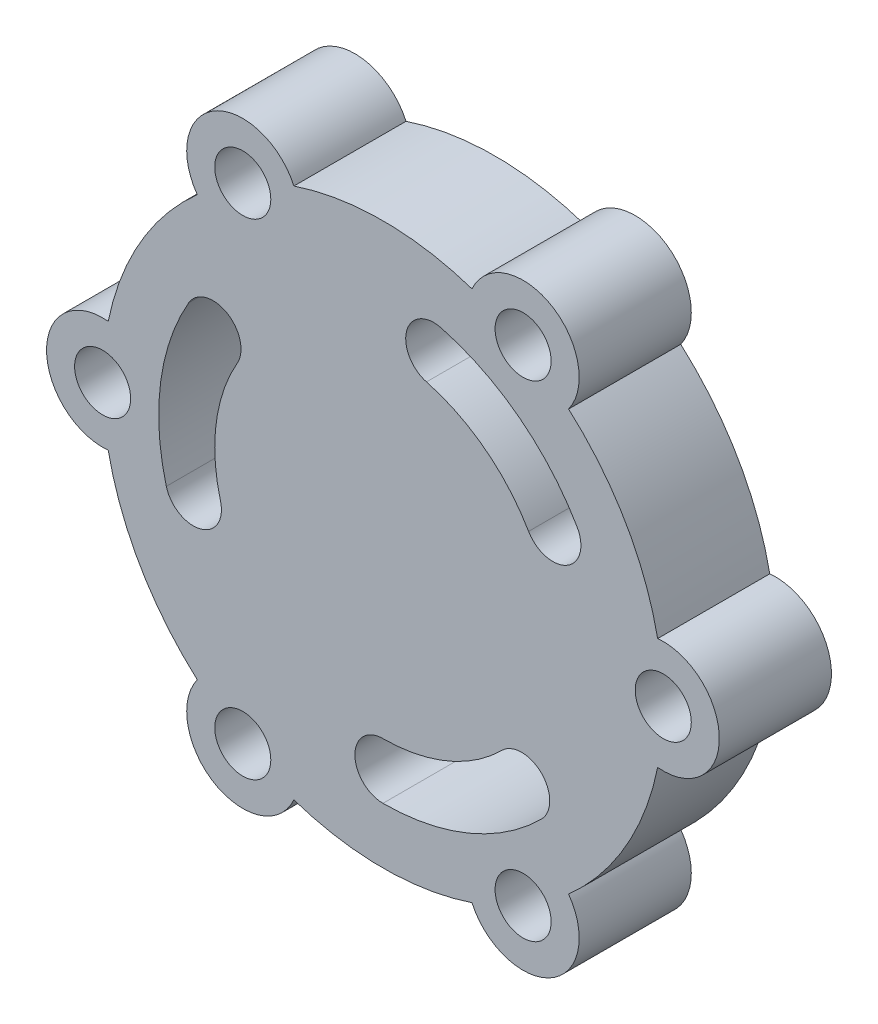
ISO-10303-21;
HEADER;
FILE_DESCRIPTION(('STEP AP214'),'2;1');
FILE_NAME('part.step','',(''),(''),'','','');
FILE_SCHEMA(('AUTOMOTIVE_DESIGN { 1 0 10303 214 1 1 1 1 }'));
ENDSEC;
DATA;
#1=APPLICATION_CONTEXT('core data for automotive mechanical design processes');
#2=APPLICATION_PROTOCOL_DEFINITION('international standard','automotive_design',2000,#1);
#3=PRODUCT_CONTEXT('',#1,'mechanical');
#4=PRODUCT('Part','Part','',(#3));
#5=PRODUCT_RELATED_PRODUCT_CATEGORY('part','',(#4));
#6=PRODUCT_DEFINITION_FORMATION('','',#4);
#7=PRODUCT_DEFINITION_CONTEXT('part definition',#1,'design');
#8=PRODUCT_DEFINITION('design','',#6,#7);
#9=PRODUCT_DEFINITION_SHAPE('','',#8);
#10=(LENGTH_UNIT() NAMED_UNIT(*) SI_UNIT(.MILLI.,.METRE.));
#11=(NAMED_UNIT(*) PLANE_ANGLE_UNIT() SI_UNIT($,.RADIAN.));
#12=(NAMED_UNIT(*) SI_UNIT($,.STERADIAN.) SOLID_ANGLE_UNIT());
#13=UNCERTAINTY_MEASURE_WITH_UNIT(LENGTH_MEASURE(1.E-05),#10,'distance_accuracy_value','');
#14=(GEOMETRIC_REPRESENTATION_CONTEXT(3) GLOBAL_UNCERTAINTY_ASSIGNED_CONTEXT((#13)) GLOBAL_UNIT_ASSIGNED_CONTEXT((#10,
#11,#12)) REPRESENTATION_CONTEXT('',''));
#15=CARTESIAN_POINT('',(0.,0.,0.));
#16=DIRECTION('',(0.,0.,1.));
#17=DIRECTION('',(1.,0.,0.));
#18=AXIS2_PLACEMENT_3D('',#15,#16,#17);
#19=CARTESIAN_POINT('',(-25.,0.,20.));
#20=DIRECTION('',(0.,0.,1.));
#21=DIRECTION('',(1.,0.,0.));
#22=AXIS2_PLACEMENT_3D('',#19,#20,#21);
#23=PLANE('',#22);
#24=CARTESIAN_POINT('',(24.9999999999996,-43.3012701892222,20.));
#25=DIRECTION('',(0.,0.,1.));
#26=DIRECTION('',(1.,0.,0.));
#27=AXIS2_PLACEMENT_3D('',#24,#25,#26);
#28=CIRCLE('',#27,5.);
#29=CARTESIAN_POINT('',(29.9999999999996,-43.3012701892222,20.));
#30=VERTEX_POINT('',#29);
#31=EDGE_CURVE('E236',#30,#30,#28,.T.);
#32=ORIENTED_EDGE('',*,*,#31,.F.);
#33=EDGE_LOOP('',(#32));
#34=FACE_BOUND('',#33,.T.);
#35=CARTESIAN_POINT('',(25.0000000000002,43.3012701892218,20.));
#36=DIRECTION('',(0.,0.,1.));
#37=DIRECTION('',(1.,0.,0.));
#38=AXIS2_PLACEMENT_3D('',#35,#36,#37);
#39=CIRCLE('',#38,5.);
#40=CARTESIAN_POINT('',(30.0000000000002,43.3012701892218,20.));
#41=VERTEX_POINT('',#40);
#42=EDGE_CURVE('E248',#41,#41,#39,.T.);
#43=ORIENTED_EDGE('',*,*,#42,.F.);
#44=EDGE_LOOP('',(#43));
#45=FACE_BOUND('',#44,.T.);
#46=CARTESIAN_POINT('',(0.,0.,20.));
#47=DIRECTION('',(0.,0.,1.));
#48=DIRECTION('',(1.,0.,0.));
#49=AXIS2_PLACEMENT_3D('',#46,#47,#48);
#50=CIRCLE('',#49,40.);
#51=CARTESIAN_POINT('',(-1.13929291158899E-13,-40.,20.));
#52=VERTEX_POINT('',#51);
#53=CARTESIAN_POINT('',(28.2842712474619,-28.2842712474619,20.));
#54=VERTEX_POINT('',#53);
#55=EDGE_CURVE('E262',#52,#54,#50,.T.);
#56=ORIENTED_EDGE('',*,*,#55,.F.);
#57=CARTESIAN_POINT('',(0.,-35.,20.));
#58=DIRECTION('',(0.,0.,1.));
#59=DIRECTION('',(1.,0.,0.));
#60=AXIS2_PLACEMENT_3D('',#57,#58,#59);
#61=CIRCLE('',#60,5.);
#62=CARTESIAN_POINT('',(0.,-30.,20.));
#63=VERTEX_POINT('',#62);
#64=EDGE_CURVE('E260',#63,#52,#61,.T.);
#65=ORIENTED_EDGE('',*,*,#64,.F.);
#66=CARTESIAN_POINT('',(0.,0.,20.));
#67=DIRECTION('',(0.,0.,-1.));
#68=DIRECTION('',(1.,0.,0.));
#69=AXIS2_PLACEMENT_3D('',#66,#67,#68);
#70=CIRCLE('',#69,30.);
#71=CARTESIAN_POINT('',(21.2132034355964,-21.2132034355965,20.));
#72=VERTEX_POINT('',#71);
#73=EDGE_CURVE('E268',#72,#63,#70,.T.);
#74=ORIENTED_EDGE('',*,*,#73,.F.);
#75=CARTESIAN_POINT('',(24.7487373415291,-24.7487373415292,20.));
#76=DIRECTION('',(0.,0.,1.));
#77=DIRECTION('',(1.,0.,0.));
#78=AXIS2_PLACEMENT_3D('',#75,#76,#77);
#79=CIRCLE('',#78,5.);
#80=EDGE_CURVE('E265',#54,#72,#79,.T.);
#81=ORIENTED_EDGE('',*,*,#80,.F.);
#82=EDGE_LOOP('',(#56,#65,#74,#81));
#83=FACE_BOUND('',#82,.T.);
#84=CARTESIAN_POINT('',(0.,0.,20.));
#85=DIRECTION('',(0.,0.,1.));
#86=DIRECTION('',(1.,0.,0.));
#87=AXIS2_PLACEMENT_3D('',#84,#85,#86);
#88=CIRCLE('',#87,40.);
#89=CARTESIAN_POINT('',(34.6410161513775,20.0000000000001,20.));
#90=VERTEX_POINT('',#89);
#91=CARTESIAN_POINT('',(10.3527618041007,38.6370330515628,20.));
#92=VERTEX_POINT('',#91);
#93=EDGE_CURVE('E293',#90,#92,#88,.T.);
#94=ORIENTED_EDGE('',*,*,#93,.F.);
#95=CARTESIAN_POINT('',(30.3108891324553,17.5000000000001,20.));
#96=DIRECTION('',(0.,0.,1.));
#97=DIRECTION('',(1.,0.,0.));
#98=AXIS2_PLACEMENT_3D('',#95,#96,#97);
#99=CIRCLE('',#98,5.);
#100=CARTESIAN_POINT('',(25.9807621135331,15.0000000000001,20.));
#101=VERTEX_POINT('',#100);
#102=EDGE_CURVE('E291',#101,#90,#99,.T.);
#103=ORIENTED_EDGE('',*,*,#102,.F.);
#104=CARTESIAN_POINT('',(0.,0.,20.));
#105=DIRECTION('',(0.,0.,-1.));
#106=DIRECTION('',(1.,0.,0.));
#107=AXIS2_PLACEMENT_3D('',#104,#105,#106);
#108=CIRCLE('',#107,30.);
#109=CARTESIAN_POINT('',(7.76457135307553,28.9777747886721,20.));
#110=VERTEX_POINT('',#109);
#111=EDGE_CURVE('E299',#110,#101,#108,.T.);
#112=ORIENTED_EDGE('',*,*,#111,.F.);
#113=CARTESIAN_POINT('',(9.05866657858811,33.8074039201174,20.));
#114=DIRECTION('',(0.,0.,1.));
#115=DIRECTION('',(1.,0.,0.));
#116=AXIS2_PLACEMENT_3D('',#113,#114,#115);
#117=CIRCLE('',#116,5.);
#118=EDGE_CURVE('E296',#92,#110,#117,.T.);
#119=ORIENTED_EDGE('',*,*,#118,.F.);
#120=EDGE_LOOP('',(#94,#103,#112,#119));
#121=FACE_BOUND('',#120,.T.);
#122=CARTESIAN_POINT('',(-50.,0.,20.));
#123=DIRECTION('',(0.,0.,1.));
#124=DIRECTION('',(1.,0.,0.));
#125=AXIS2_PLACEMENT_3D('',#122,#123,#124);
#126=CIRCLE('',#125,5.);
#127=CARTESIAN_POINT('',(-45.,0.,20.));
#128=VERTEX_POINT('',#127);
#129=EDGE_CURVE('E322',#128,#128,#126,.T.);
#130=ORIENTED_EDGE('',*,*,#129,.F.);
#131=EDGE_LOOP('',(#130));
#132=FACE_BOUND('',#131,.T.);
#133=CARTESIAN_POINT('',(-50.,0.,20.));
#134=DIRECTION('',(0.,0.,1.));
#135=DIRECTION('',(1.,0.,0.));
#136=AXIS2_PLACEMENT_3D('',#133,#134,#135);
#137=CIRCLE('',#136,10.);
#138=CARTESIAN_POINT('',(-49.,9.9498743710662,20.));
#139=VERTEX_POINT('',#138);
#140=CARTESIAN_POINT('',(-49.,-9.94987437106619,20.));
#141=VERTEX_POINT('',#140);
#142=EDGE_CURVE('E328',#139,#141,#137,.T.);
#143=ORIENTED_EDGE('',*,*,#142,.T.);
#144=CARTESIAN_POINT('',(0.,0.,20.));
#145=DIRECTION('',(0.,0.,1.));
#146=DIRECTION('',(1.,0.,0.));
#147=AXIS2_PLACEMENT_3D('',#144,#145,#146);
#148=CIRCLE('',#147,50.);
#149=CARTESIAN_POINT('',(-33.1168439698075,-37.460307599904,20.));
#150=VERTEX_POINT('',#149);
#151=EDGE_CURVE('E331',#141,#150,#148,.T.);
#152=ORIENTED_EDGE('',*,*,#151,.T.);
#153=CARTESIAN_POINT('',(-25.,-43.301270189222,20.));
#154=DIRECTION('',(0.,0.,1.));
#155=DIRECTION('',(1.,0.,0.));
#156=AXIS2_PLACEMENT_3D('',#153,#154,#155);
#157=CIRCLE('',#156,10.);
#158=CARTESIAN_POINT('',(-15.8831560301929,-47.4101819709707,20.));
#159=VERTEX_POINT('',#158);
#160=EDGE_CURVE('E334',#150,#159,#157,.T.);
#161=ORIENTED_EDGE('',*,*,#160,.T.);
#162=CARTESIAN_POINT('',(0.,0.,20.));
#163=DIRECTION('',(0.,0.,1.));
#164=DIRECTION('',(1.,0.,0.));
#165=AXIS2_PLACEMENT_3D('',#162,#163,#164);
#166=CIRCLE('',#165,50.);
#167=CARTESIAN_POINT('',(15.8831560301925,-47.4101819709708,20.));
#168=VERTEX_POINT('',#167);
#169=EDGE_CURVE('E336',#159,#168,#166,.T.);
#170=ORIENTED_EDGE('',*,*,#169,.T.);
#171=CARTESIAN_POINT('',(24.9999999999996,-43.3012701892222,20.));
#172=DIRECTION('',(0.,0.,1.));
#173=DIRECTION('',(1.,0.,0.));
#174=AXIS2_PLACEMENT_3D('',#171,#172,#173);
#175=CIRCLE('',#174,10.);
#176=CARTESIAN_POINT('',(33.1168439698067,-37.4603075999047,20.));
#177=VERTEX_POINT('',#176);
#178=EDGE_CURVE('E338',#168,#177,#175,.T.);
#179=ORIENTED_EDGE('',*,*,#178,.T.);
#180=CARTESIAN_POINT('',(0.,0.,20.));
#181=DIRECTION('',(0.,0.,1.));
#182=DIRECTION('',(1.,0.,0.));
#183=AXIS2_PLACEMENT_3D('',#180,#181,#182);
#184=CIRCLE('',#183,50.);
#185=CARTESIAN_POINT('',(48.9999999999999,-9.94987437106655,20.));
#186=VERTEX_POINT('',#185);
#187=EDGE_CURVE('E340',#177,#186,#184,.T.);
#188=ORIENTED_EDGE('',*,*,#187,.T.);
#189=CARTESIAN_POINT('',(50.,-3.49148133884313E-13,20.));
#190=DIRECTION('',(0.,0.,1.));
#191=DIRECTION('',(1.,0.,0.));
#192=AXIS2_PLACEMENT_3D('',#189,#190,#191);
#193=CIRCLE('',#192,10.);
#194=CARTESIAN_POINT('',(49.0000000000001,9.94987437106587,20.));
#195=VERTEX_POINT('',#194);
#196=EDGE_CURVE('E342',#186,#195,#193,.T.);
#197=ORIENTED_EDGE('',*,*,#196,.T.);
#198=CARTESIAN_POINT('',(0.,0.,20.));
#199=DIRECTION('',(0.,0.,1.));
#200=DIRECTION('',(1.,0.,0.));
#201=AXIS2_PLACEMENT_3D('',#198,#199,#200);
#202=CIRCLE('',#201,50.);
#203=CARTESIAN_POINT('',(33.1168439698072,37.4603075999042,20.));
#204=VERTEX_POINT('',#203);
#205=EDGE_CURVE('E344',#195,#204,#202,.T.);
#206=ORIENTED_EDGE('',*,*,#205,.T.);
#207=CARTESIAN_POINT('',(25.0000000000002,43.3012701892218,20.));
#208=DIRECTION('',(0.,0.,1.));
#209=DIRECTION('',(1.,0.,0.));
#210=AXIS2_PLACEMENT_3D('',#207,#208,#209);
#211=CIRCLE('',#210,10.);
#212=CARTESIAN_POINT('',(15.8831560301932,47.4101819709705,20.));
#213=VERTEX_POINT('',#212);
#214=EDGE_CURVE('E346',#204,#213,#211,.T.);
#215=ORIENTED_EDGE('',*,*,#214,.T.);
#216=CARTESIAN_POINT('',(0.,0.,20.));
#217=DIRECTION('',(0.,0.,1.));
#218=DIRECTION('',(1.,0.,0.));
#219=AXIS2_PLACEMENT_3D('',#216,#217,#218);
#220=CIRCLE('',#219,50.);
#221=CARTESIAN_POINT('',(-15.8831560301929,47.4101819709706,20.));
#222=VERTEX_POINT('',#221);
#223=EDGE_CURVE('E348',#213,#222,#220,.T.);
#224=ORIENTED_EDGE('',*,*,#223,.T.);
#225=CARTESIAN_POINT('',(-24.9999999999999,43.301270189222,20.));
#226=DIRECTION('',(0.,0.,1.));
#227=DIRECTION('',(1.,0.,0.));
#228=AXIS2_PLACEMENT_3D('',#225,#226,#227);
#229=CIRCLE('',#228,10.);
#230=CARTESIAN_POINT('',(-33.116843969807,37.4603075999045,20.));
#231=VERTEX_POINT('',#230);
#232=EDGE_CURVE('E350',#222,#231,#229,.T.);
#233=ORIENTED_EDGE('',*,*,#232,.T.);
#234=CARTESIAN_POINT('',(0.,0.,20.));
#235=DIRECTION('',(0.,0.,1.));
#236=DIRECTION('',(1.,0.,0.));
#237=AXIS2_PLACEMENT_3D('',#234,#235,#236);
#238=CIRCLE('',#237,50.);
#239=EDGE_CURVE('E352',#231,#139,#238,.T.);
#240=ORIENTED_EDGE('',*,*,#239,.T.);
#241=EDGE_LOOP('',(#143,#152,#161,#170,#179,#188,#197,#206,#215,#224,#233,#240));
#242=FACE_BOUND('',#241,.T.);
#243=CARTESIAN_POINT('',(-24.9999999999999,43.301270189222,20.));
#244=DIRECTION('',(0.,0.,1.));
#245=DIRECTION('',(1.,0.,0.));
#246=AXIS2_PLACEMENT_3D('',#243,#244,#245);
#247=CIRCLE('',#246,5.);
#248=CARTESIAN_POINT('',(-19.9999999999999,43.301270189222,20.));
#249=VERTEX_POINT('',#248);
#250=EDGE_CURVE('E254',#249,#249,#247,.T.);
#251=ORIENTED_EDGE('',*,*,#250,.F.);
#252=EDGE_LOOP('',(#251));
#253=FACE_BOUND('',#252,.T.);
#254=CARTESIAN_POINT('',(50.,-3.49148133884313E-13,20.));
#255=DIRECTION('',(0.,0.,1.));
#256=DIRECTION('',(1.,0.,0.));
#257=AXIS2_PLACEMENT_3D('',#254,#255,#256);
#258=CIRCLE('',#257,4.99999999999999);
#259=CARTESIAN_POINT('',(55.,-3.49148133884313E-13,20.));
#260=VERTEX_POINT('',#259);
#261=EDGE_CURVE('E242',#260,#260,#258,.T.);
#262=ORIENTED_EDGE('',*,*,#261,.F.);
#263=EDGE_LOOP('',(#262));
#264=FACE_BOUND('',#263,.T.);
#265=CARTESIAN_POINT('',(-25.,-43.301270189222,20.));
#266=DIRECTION('',(0.,0.,1.));
#267=DIRECTION('',(1.,0.,0.));
#268=AXIS2_PLACEMENT_3D('',#265,#266,#267);
#269=CIRCLE('',#268,5.00000000000019);
#270=CARTESIAN_POINT('',(-19.9999999999998,-43.301270189222,20.));
#271=VERTEX_POINT('',#270);
#272=EDGE_CURVE('E230',#271,#271,#269,.T.);
#273=ORIENTED_EDGE('',*,*,#272,.F.);
#274=EDGE_LOOP('',(#273));
#275=FACE_BOUND('',#274,.T.);
#276=CARTESIAN_POINT('',(0.,0.,20.));
#277=DIRECTION('',(0.,0.,1.));
#278=DIRECTION('',(1.,0.,0.));
#279=AXIS2_PLACEMENT_3D('',#276,#277,#278);
#280=CIRCLE('',#279,40.);
#281=CARTESIAN_POINT('',(-34.6410161513774,20.0000000000002,20.));
#282=VERTEX_POINT('',#281);
#283=CARTESIAN_POINT('',(-38.6370330515628,-10.3527618041006,20.));
#284=VERTEX_POINT('',#283);
#285=EDGE_CURVE('E202',#282,#284,#280,.T.);
#286=ORIENTED_EDGE('',*,*,#285,.F.);
#287=CARTESIAN_POINT('',(-30.3108891324552,17.5000000000002,20.));
#288=DIRECTION('',(0.,0.,1.));
#289=DIRECTION('',(1.,0.,0.));
#290=AXIS2_PLACEMENT_3D('',#287,#288,#289);
#291=CIRCLE('',#290,5.);
#292=CARTESIAN_POINT('',(-25.980762113533,15.0000000000002,20.));
#293=VERTEX_POINT('',#292);
#294=EDGE_CURVE('E194',#293,#282,#291,.T.);
#295=ORIENTED_EDGE('',*,*,#294,.F.);
#296=CARTESIAN_POINT('',(0.,0.,20.));
#297=DIRECTION('',(0.,0.,-1.));
#298=DIRECTION('',(1.,0.,0.));
#299=AXIS2_PLACEMENT_3D('',#296,#297,#298);
#300=CIRCLE('',#299,30.);
#301=CARTESIAN_POINT('',(-28.9777747886721,-7.76457135307546,20.));
#302=VERTEX_POINT('',#301);
#303=EDGE_CURVE('E216',#302,#293,#300,.T.);
#304=ORIENTED_EDGE('',*,*,#303,.F.);
#305=CARTESIAN_POINT('',(-33.8074039201174,-9.05866657858803,20.));
#306=DIRECTION('',(0.,0.,1.));
#307=DIRECTION('',(1.,0.,0.));
#308=AXIS2_PLACEMENT_3D('',#305,#306,#307);
#309=CIRCLE('',#308,5.);
#310=EDGE_CURVE('E214',#284,#302,#309,.T.);
#311=ORIENTED_EDGE('',*,*,#310,.F.);
#312=EDGE_LOOP('',(#286,#295,#304,#311));
#313=FACE_BOUND('',#312,.T.);
#314=ADVANCED_FACE('F33',(#34,#45,#83,#121,#132,#242,#253,#264,#275,#313),#23,.T.);
#315=CARTESIAN_POINT('',(-25.,0.,0.));
#316=DIRECTION('',(0.,0.,1.));
#317=DIRECTION('',(1.,0.,0.));
#318=AXIS2_PLACEMENT_3D('',#315,#316,#317);
#319=PLANE('',#318);
#320=CARTESIAN_POINT('',(-25.,-43.301270189222,0.));
#321=DIRECTION('',(0.,0.,1.));
#322=DIRECTION('',(1.,0.,0.));
#323=AXIS2_PLACEMENT_3D('',#320,#321,#322);
#324=CIRCLE('',#323,5.00000000000019);
#325=CARTESIAN_POINT('',(-19.9999999999998,-43.301270189222,0.));
#326=VERTEX_POINT('',#325);
#327=EDGE_CURVE('E210',#326,#326,#324,.T.);
#328=ORIENTED_EDGE('',*,*,#327,.T.);
#329=EDGE_LOOP('',(#328));
#330=FACE_BOUND('',#329,.T.);
#331=CARTESIAN_POINT('',(24.9999999999996,-43.3012701892222,0.));
#332=DIRECTION('',(0.,0.,1.));
#333=DIRECTION('',(1.,0.,0.));
#334=AXIS2_PLACEMENT_3D('',#331,#332,#333);
#335=CIRCLE('',#334,5.);
#336=CARTESIAN_POINT('',(29.9999999999996,-43.3012701892222,0.));
#337=VERTEX_POINT('',#336);
#338=EDGE_CURVE('E233',#337,#337,#335,.T.);
#339=ORIENTED_EDGE('',*,*,#338,.T.);
#340=EDGE_LOOP('',(#339));
#341=FACE_BOUND('',#340,.T.);
#342=CARTESIAN_POINT('',(50.,-3.49148133884313E-13,0.));
#343=DIRECTION('',(0.,0.,1.));
#344=DIRECTION('',(1.,0.,0.));
#345=AXIS2_PLACEMENT_3D('',#342,#343,#344);
#346=CIRCLE('',#345,4.99999999999999);
#347=CARTESIAN_POINT('',(55.,-3.49148133884313E-13,0.));
#348=VERTEX_POINT('',#347);
#349=EDGE_CURVE('E239',#348,#348,#346,.T.);
#350=ORIENTED_EDGE('',*,*,#349,.T.);
#351=EDGE_LOOP('',(#350));
#352=FACE_BOUND('',#351,.T.);
#353=CARTESIAN_POINT('',(25.0000000000002,43.3012701892218,0.));
#354=DIRECTION('',(0.,0.,1.));
#355=DIRECTION('',(1.,0.,0.));
#356=AXIS2_PLACEMENT_3D('',#353,#354,#355);
#357=CIRCLE('',#356,5.);
#358=CARTESIAN_POINT('',(30.0000000000002,43.3012701892218,0.));
#359=VERTEX_POINT('',#358);
#360=EDGE_CURVE('E245',#359,#359,#357,.T.);
#361=ORIENTED_EDGE('',*,*,#360,.T.);
#362=EDGE_LOOP('',(#361));
#363=FACE_BOUND('',#362,.T.);
#364=CARTESIAN_POINT('',(-24.9999999999999,43.301270189222,0.));
#365=DIRECTION('',(0.,0.,1.));
#366=DIRECTION('',(1.,0.,0.));
#367=AXIS2_PLACEMENT_3D('',#364,#365,#366);
#368=CIRCLE('',#367,5.);
#369=CARTESIAN_POINT('',(-19.9999999999999,43.301270189222,0.));
#370=VERTEX_POINT('',#369);
#371=EDGE_CURVE('E251',#370,#370,#368,.T.);
#372=ORIENTED_EDGE('',*,*,#371,.T.);
#373=EDGE_LOOP('',(#372));
#374=FACE_BOUND('',#373,.T.);
#375=CARTESIAN_POINT('',(0.,-35.,0.));
#376=DIRECTION('',(0.,0.,1.));
#377=DIRECTION('',(1.,0.,0.));
#378=AXIS2_PLACEMENT_3D('',#375,#376,#377);
#379=CIRCLE('',#378,5.);
#380=CARTESIAN_POINT('',(0.,-30.,0.));
#381=VERTEX_POINT('',#380);
#382=CARTESIAN_POINT('',(-1.13929291158899E-13,-40.,0.));
#383=VERTEX_POINT('',#382);
#384=EDGE_CURVE('E257',#381,#383,#379,.T.);
#385=ORIENTED_EDGE('',*,*,#384,.T.);
#386=CARTESIAN_POINT('',(0.,0.,0.));
#387=DIRECTION('',(0.,0.,1.));
#388=DIRECTION('',(1.,0.,0.));
#389=AXIS2_PLACEMENT_3D('',#386,#387,#388);
#390=CIRCLE('',#389,40.);
#391=CARTESIAN_POINT('',(28.2842712474619,-28.2842712474619,0.));
#392=VERTEX_POINT('',#391);
#393=EDGE_CURVE('E273',#383,#392,#390,.T.);
#394=ORIENTED_EDGE('',*,*,#393,.T.);
#395=CARTESIAN_POINT('',(24.7487373415291,-24.7487373415292,0.));
#396=DIRECTION('',(0.,0.,1.));
#397=DIRECTION('',(1.,0.,0.));
#398=AXIS2_PLACEMENT_3D('',#395,#396,#397);
#399=CIRCLE('',#398,5.);
#400=CARTESIAN_POINT('',(21.2132034355964,-21.2132034355965,0.));
#401=VERTEX_POINT('',#400);
#402=EDGE_CURVE('E276',#392,#401,#399,.T.);
#403=ORIENTED_EDGE('',*,*,#402,.T.);
#404=CARTESIAN_POINT('',(0.,0.,0.));
#405=DIRECTION('',(0.,0.,-1.));
#406=DIRECTION('',(1.,0.,0.));
#407=AXIS2_PLACEMENT_3D('',#404,#405,#406);
#408=CIRCLE('',#407,30.);
#409=EDGE_CURVE('E263',#401,#381,#408,.T.);
#410=ORIENTED_EDGE('',*,*,#409,.T.);
#411=EDGE_LOOP('',(#385,#394,#403,#410));
#412=FACE_BOUND('',#411,.T.);
#413=CARTESIAN_POINT('',(-50.,0.,0.));
#414=DIRECTION('',(0.,0.,1.));
#415=DIRECTION('',(1.,0.,0.));
#416=AXIS2_PLACEMENT_3D('',#413,#414,#415);
#417=CIRCLE('',#416,5.);
#418=CARTESIAN_POINT('',(-45.,0.,0.));
#419=VERTEX_POINT('',#418);
#420=EDGE_CURVE('E321',#419,#419,#417,.T.);
#421=ORIENTED_EDGE('',*,*,#420,.T.);
#422=EDGE_LOOP('',(#421));
#423=FACE_BOUND('',#422,.T.);
#424=CARTESIAN_POINT('',(-50.,0.,0.));
#425=DIRECTION('',(0.,0.,1.));
#426=DIRECTION('',(1.,0.,0.));
#427=AXIS2_PLACEMENT_3D('',#424,#425,#426);
#428=CIRCLE('',#427,10.);
#429=CARTESIAN_POINT('',(-49.,9.9498743710662,0.));
#430=VERTEX_POINT('',#429);
#431=CARTESIAN_POINT('',(-49.,-9.94987437106619,0.));
#432=VERTEX_POINT('',#431);
#433=EDGE_CURVE('E325',#430,#432,#428,.T.);
#434=ORIENTED_EDGE('',*,*,#433,.F.);
#435=CARTESIAN_POINT('',(0.,0.,0.));
#436=DIRECTION('',(0.,0.,1.));
#437=DIRECTION('',(1.,0.,0.));
#438=AXIS2_PLACEMENT_3D('',#435,#436,#437);
#439=CIRCLE('',#438,50.);
#440=CARTESIAN_POINT('',(-33.116843969807,37.4603075999045,0.));
#441=VERTEX_POINT('',#440);
#442=EDGE_CURVE('E332',#441,#430,#439,.T.);
#443=ORIENTED_EDGE('',*,*,#442,.F.);
#444=CARTESIAN_POINT('',(-24.9999999999999,43.301270189222,0.));
#445=DIRECTION('',(0.,0.,1.));
#446=DIRECTION('',(1.,0.,0.));
#447=AXIS2_PLACEMENT_3D('',#444,#445,#446);
#448=CIRCLE('',#447,10.);
#449=CARTESIAN_POINT('',(-15.8831560301929,47.4101819709706,0.));
#450=VERTEX_POINT('',#449);
#451=EDGE_CURVE('E375',#450,#441,#448,.T.);
#452=ORIENTED_EDGE('',*,*,#451,.F.);
#453=CARTESIAN_POINT('',(0.,0.,0.));
#454=DIRECTION('',(0.,0.,1.));
#455=DIRECTION('',(1.,0.,0.));
#456=AXIS2_PLACEMENT_3D('',#453,#454,#455);
#457=CIRCLE('',#456,50.);
#458=CARTESIAN_POINT('',(15.8831560301932,47.4101819709705,0.));
#459=VERTEX_POINT('',#458);
#460=EDGE_CURVE('E373',#459,#450,#457,.T.);
#461=ORIENTED_EDGE('',*,*,#460,.F.);
#462=CARTESIAN_POINT('',(25.0000000000002,43.3012701892218,0.));
#463=DIRECTION('',(0.,0.,1.));
#464=DIRECTION('',(1.,0.,0.));
#465=AXIS2_PLACEMENT_3D('',#462,#463,#464);
#466=CIRCLE('',#465,10.);
#467=CARTESIAN_POINT('',(33.1168439698072,37.4603075999042,0.));
#468=VERTEX_POINT('',#467);
#469=EDGE_CURVE('E371',#468,#459,#466,.T.);
#470=ORIENTED_EDGE('',*,*,#469,.F.);
#471=CARTESIAN_POINT('',(0.,0.,0.));
#472=DIRECTION('',(0.,0.,1.));
#473=DIRECTION('',(1.,0.,0.));
#474=AXIS2_PLACEMENT_3D('',#471,#472,#473);
#475=CIRCLE('',#474,50.);
#476=CARTESIAN_POINT('',(49.0000000000001,9.94987437106587,0.));
#477=VERTEX_POINT('',#476);
#478=EDGE_CURVE('E369',#477,#468,#475,.T.);
#479=ORIENTED_EDGE('',*,*,#478,.F.);
#480=CARTESIAN_POINT('',(50.,-3.49148133884313E-13,0.));
#481=DIRECTION('',(0.,0.,1.));
#482=DIRECTION('',(1.,0.,0.));
#483=AXIS2_PLACEMENT_3D('',#480,#481,#482);
#484=CIRCLE('',#483,10.);
#485=CARTESIAN_POINT('',(48.9999999999999,-9.94987437106655,0.));
#486=VERTEX_POINT('',#485);
#487=EDGE_CURVE('E367',#486,#477,#484,.T.);
#488=ORIENTED_EDGE('',*,*,#487,.F.);
#489=CARTESIAN_POINT('',(0.,0.,0.));
#490=DIRECTION('',(0.,0.,1.));
#491=DIRECTION('',(1.,0.,0.));
#492=AXIS2_PLACEMENT_3D('',#489,#490,#491);
#493=CIRCLE('',#492,50.);
#494=CARTESIAN_POINT('',(33.1168439698067,-37.4603075999047,0.));
#495=VERTEX_POINT('',#494);
#496=EDGE_CURVE('E365',#495,#486,#493,.T.);
#497=ORIENTED_EDGE('',*,*,#496,.F.);
#498=CARTESIAN_POINT('',(24.9999999999996,-43.3012701892222,0.));
#499=DIRECTION('',(0.,0.,1.));
#500=DIRECTION('',(1.,0.,0.));
#501=AXIS2_PLACEMENT_3D('',#498,#499,#500);
#502=CIRCLE('',#501,10.);
#503=CARTESIAN_POINT('',(15.8831560301925,-47.4101819709708,0.));
#504=VERTEX_POINT('',#503);
#505=EDGE_CURVE('E363',#504,#495,#502,.T.);
#506=ORIENTED_EDGE('',*,*,#505,.F.);
#507=CARTESIAN_POINT('',(0.,0.,0.));
#508=DIRECTION('',(0.,0.,1.));
#509=DIRECTION('',(1.,0.,0.));
#510=AXIS2_PLACEMENT_3D('',#507,#508,#509);
#511=CIRCLE('',#510,50.);
#512=CARTESIAN_POINT('',(-15.8831560301929,-47.4101819709707,0.));
#513=VERTEX_POINT('',#512);
#514=EDGE_CURVE('E361',#513,#504,#511,.T.);
#515=ORIENTED_EDGE('',*,*,#514,.F.);
#516=CARTESIAN_POINT('',(-25.,-43.301270189222,0.));
#517=DIRECTION('',(0.,0.,1.));
#518=DIRECTION('',(1.,0.,0.));
#519=AXIS2_PLACEMENT_3D('',#516,#517,#518);
#520=CIRCLE('',#519,10.);
#521=CARTESIAN_POINT('',(-33.1168439698075,-37.460307599904,0.));
#522=VERTEX_POINT('',#521);
#523=EDGE_CURVE('E359',#522,#513,#520,.T.);
#524=ORIENTED_EDGE('',*,*,#523,.F.);
#525=CARTESIAN_POINT('',(0.,0.,0.));
#526=DIRECTION('',(0.,0.,1.));
#527=DIRECTION('',(1.,0.,0.));
#528=AXIS2_PLACEMENT_3D('',#525,#526,#527);
#529=CIRCLE('',#528,50.);
#530=EDGE_CURVE('E357',#432,#522,#529,.T.);
#531=ORIENTED_EDGE('',*,*,#530,.F.);
#532=EDGE_LOOP('',(#434,#443,#452,#461,#470,#479,#488,#497,#506,#515,#524,#531));
#533=FACE_BOUND('',#532,.T.);
#534=CARTESIAN_POINT('',(30.3108891324553,17.5000000000001,0.));
#535=DIRECTION('',(0.,0.,1.));
#536=DIRECTION('',(1.,0.,0.));
#537=AXIS2_PLACEMENT_3D('',#534,#535,#536);
#538=CIRCLE('',#537,5.);
#539=CARTESIAN_POINT('',(25.9807621135331,15.0000000000001,0.));
#540=VERTEX_POINT('',#539);
#541=CARTESIAN_POINT('',(34.6410161513775,20.0000000000001,0.));
#542=VERTEX_POINT('',#541);
#543=EDGE_CURVE('E290',#540,#542,#538,.T.);
#544=ORIENTED_EDGE('',*,*,#543,.T.);
#545=CARTESIAN_POINT('',(0.,0.,0.));
#546=DIRECTION('',(0.,0.,1.));
#547=DIRECTION('',(1.,0.,0.));
#548=AXIS2_PLACEMENT_3D('',#545,#546,#547);
#549=CIRCLE('',#548,40.);
#550=CARTESIAN_POINT('',(10.3527618041007,38.6370330515628,0.));
#551=VERTEX_POINT('',#550);
#552=EDGE_CURVE('E304',#542,#551,#549,.T.);
#553=ORIENTED_EDGE('',*,*,#552,.T.);
#554=CARTESIAN_POINT('',(9.05866657858811,33.8074039201174,0.));
#555=DIRECTION('',(0.,0.,1.));
#556=DIRECTION('',(1.,0.,0.));
#557=AXIS2_PLACEMENT_3D('',#554,#555,#556);
#558=CIRCLE('',#557,5.);
#559=CARTESIAN_POINT('',(7.76457135307553,28.9777747886721,0.));
#560=VERTEX_POINT('',#559);
#561=EDGE_CURVE('E307',#551,#560,#558,.T.);
#562=ORIENTED_EDGE('',*,*,#561,.T.);
#563=CARTESIAN_POINT('',(0.,0.,0.));
#564=DIRECTION('',(0.,0.,-1.));
#565=DIRECTION('',(1.,0.,0.));
#566=AXIS2_PLACEMENT_3D('',#563,#564,#565);
#567=CIRCLE('',#566,30.);
#568=EDGE_CURVE('E294',#560,#540,#567,.T.);
#569=ORIENTED_EDGE('',*,*,#568,.T.);
#570=EDGE_LOOP('',(#544,#553,#562,#569));
#571=FACE_BOUND('',#570,.T.);
#572=CARTESIAN_POINT('',(-30.3108891324552,17.5000000000002,0.));
#573=DIRECTION('',(0.,0.,1.));
#574=DIRECTION('',(1.,0.,0.));
#575=AXIS2_PLACEMENT_3D('',#572,#573,#574);
#576=CIRCLE('',#575,5.);
#577=CARTESIAN_POINT('',(-25.9807621135331,15.0000000000002,0.));
#578=VERTEX_POINT('',#577);
#579=CARTESIAN_POINT('',(-34.6410161513774,20.0000000000002,0.));
#580=VERTEX_POINT('',#579);
#581=EDGE_CURVE('E56',#578,#580,#576,.T.);
#582=ORIENTED_EDGE('',*,*,#581,.T.);
#583=CARTESIAN_POINT('',(0.,0.,0.));
#584=DIRECTION('',(0.,0.,1.));
#585=DIRECTION('',(1.,0.,0.));
#586=AXIS2_PLACEMENT_3D('',#583,#584,#585);
#587=CIRCLE('',#586,40.);
#588=CARTESIAN_POINT('',(-38.6370330515628,-10.3527618041006,0.));
#589=VERTEX_POINT('',#588);
#590=EDGE_CURVE('E209',#580,#589,#587,.T.);
#591=ORIENTED_EDGE('',*,*,#590,.T.);
#592=CARTESIAN_POINT('',(-33.8074039201174,-9.05866657858803,0.));
#593=DIRECTION('',(0.,0.,1.));
#594=DIRECTION('',(1.,0.,0.));
#595=AXIS2_PLACEMENT_3D('',#592,#593,#594);
#596=CIRCLE('',#595,5.);
#597=CARTESIAN_POINT('',(-28.9777747886721,-7.76457135307546,0.));
#598=VERTEX_POINT('',#597);
#599=EDGE_CURVE('E222',#589,#598,#596,.T.);
#600=ORIENTED_EDGE('',*,*,#599,.T.);
#601=CARTESIAN_POINT('',(0.,0.,0.));
#602=DIRECTION('',(0.,0.,-1.));
#603=DIRECTION('',(1.,0.,0.));
#604=AXIS2_PLACEMENT_3D('',#601,#602,#603);
#605=CIRCLE('',#604,30.);
#606=EDGE_CURVE('E203',#598,#578,#605,.T.);
#607=ORIENTED_EDGE('',*,*,#606,.T.);
#608=EDGE_LOOP('',(#582,#591,#600,#607));
#609=FACE_BOUND('',#608,.T.);
#610=ADVANCED_FACE('F417',(#330,#341,#352,#363,#374,#412,#423,#533,#571,#609),#319,.F.);
#611=CARTESIAN_POINT('',(-50.,0.,20.));
#612=DIRECTION('',(0.,0.,-1.));
#613=DIRECTION('',(-1.,0.,0.));
#614=AXIS2_PLACEMENT_3D('',#611,#612,#613);
#615=CYLINDRICAL_SURFACE('',#614,10.);
#616=ORIENTED_EDGE('',*,*,#433,.T.);
#617=DIRECTION('',(0.,0.,-1.));
#618=VECTOR('',#617,1.);
#619=CARTESIAN_POINT('',(-49.,-9.94987437106619,20.));
#620=LINE('',#619,#618);
#621=EDGE_CURVE('E11',#141,#432,#620,.T.);
#622=ORIENTED_EDGE('',*,*,#621,.F.);
#623=ORIENTED_EDGE('',*,*,#142,.F.);
#624=DIRECTION('',(0.,0.,-1.));
#625=VECTOR('',#624,1.);
#626=CARTESIAN_POINT('',(-49.,9.9498743710662,20.));
#627=LINE('',#626,#625);
#628=EDGE_CURVE('E354',#139,#430,#627,.T.);
#629=ORIENTED_EDGE('',*,*,#628,.T.);
#630=EDGE_LOOP('',(#616,#622,#623,#629));
#631=FACE_BOUND('',#630,.T.);
#632=ADVANCED_FACE('F35',(#631),#615,.T.);
#633=CARTESIAN_POINT('',(0.,0.,20.));
#634=DIRECTION('',(0.,0.,-1.));
#635=DIRECTION('',(-1.,0.,0.));
#636=AXIS2_PLACEMENT_3D('',#633,#634,#635);
#637=CYLINDRICAL_SURFACE('',#636,50.);
#638=ORIENTED_EDGE('',*,*,#530,.T.);
#639=DIRECTION('',(0.,0.,-1.));
#640=VECTOR('',#639,1.);
#641=CARTESIAN_POINT('',(-33.1168439698075,-37.460307599904,20.));
#642=LINE('',#641,#640);
#643=EDGE_CURVE('E41',#150,#522,#642,.T.);
#644=ORIENTED_EDGE('',*,*,#643,.F.);
#645=ORIENTED_EDGE('',*,*,#151,.F.);
#646=ORIENTED_EDGE('',*,*,#621,.T.);
#647=EDGE_LOOP('',(#638,#644,#645,#646));
#648=FACE_BOUND('',#647,.T.);
#649=ADVANCED_FACE('F435',(#648),#637,.T.);
#650=CARTESIAN_POINT('',(-25.,-43.301270189222,20.));
#651=DIRECTION('',(0.,0.,-1.));
#652=DIRECTION('',(-1.,0.,0.));
#653=AXIS2_PLACEMENT_3D('',#650,#651,#652);
#654=CYLINDRICAL_SURFACE('',#653,10.);
#655=ORIENTED_EDGE('',*,*,#523,.T.);
#656=DIRECTION('',(0.,0.,-1.));
#657=VECTOR('',#656,1.);
#658=CARTESIAN_POINT('',(-15.8831560301929,-47.4101819709707,20.));
#659=LINE('',#658,#657);
#660=EDGE_CURVE('E404',#159,#513,#659,.T.);
#661=ORIENTED_EDGE('',*,*,#660,.F.);
#662=ORIENTED_EDGE('',*,*,#160,.F.);
#663=ORIENTED_EDGE('',*,*,#643,.T.);
#664=EDGE_LOOP('',(#655,#661,#662,#663));
#665=FACE_BOUND('',#664,.T.);
#666=ADVANCED_FACE('F411',(#665),#654,.T.);
#667=CARTESIAN_POINT('',(0.,0.,20.));
#668=DIRECTION('',(0.,0.,-1.));
#669=DIRECTION('',(-1.,0.,0.));
#670=AXIS2_PLACEMENT_3D('',#667,#668,#669);
#671=CYLINDRICAL_SURFACE('',#670,50.);
#672=ORIENTED_EDGE('',*,*,#514,.T.);
#673=DIRECTION('',(0.,0.,-1.));
#674=VECTOR('',#673,1.);
#675=CARTESIAN_POINT('',(15.8831560301925,-47.4101819709708,20.));
#676=LINE('',#675,#674);
#677=EDGE_CURVE('E401',#168,#504,#676,.T.);
#678=ORIENTED_EDGE('',*,*,#677,.F.);
#679=ORIENTED_EDGE('',*,*,#169,.F.);
#680=ORIENTED_EDGE('',*,*,#660,.T.);
#681=EDGE_LOOP('',(#672,#678,#679,#680));
#682=FACE_BOUND('',#681,.T.);
#683=ADVANCED_FACE('F423',(#682),#671,.T.);
#684=CARTESIAN_POINT('',(24.9999999999996,-43.3012701892222,20.));
#685=DIRECTION('',(0.,0.,-1.));
#686=DIRECTION('',(-1.,0.,0.));
#687=AXIS2_PLACEMENT_3D('',#684,#685,#686);
#688=CYLINDRICAL_SURFACE('',#687,10.);
#689=ORIENTED_EDGE('',*,*,#505,.T.);
#690=DIRECTION('',(0.,0.,-1.));
#691=VECTOR('',#690,1.);
#692=CARTESIAN_POINT('',(33.1168439698067,-37.4603075999047,20.));
#693=LINE('',#692,#691);
#694=EDGE_CURVE('E398',#177,#495,#693,.T.);
#695=ORIENTED_EDGE('',*,*,#694,.F.);
#696=ORIENTED_EDGE('',*,*,#178,.F.);
#697=ORIENTED_EDGE('',*,*,#677,.T.);
#698=EDGE_LOOP('',(#689,#695,#696,#697));
#699=FACE_BOUND('',#698,.T.);
#700=ADVANCED_FACE('F427',(#699),#688,.T.);
#701=CARTESIAN_POINT('',(0.,0.,20.));
#702=DIRECTION('',(0.,0.,-1.));
#703=DIRECTION('',(-1.,0.,0.));
#704=AXIS2_PLACEMENT_3D('',#701,#702,#703);
#705=CYLINDRICAL_SURFACE('',#704,50.);
#706=ORIENTED_EDGE('',*,*,#496,.T.);
#707=DIRECTION('',(0.,0.,-1.));
#708=VECTOR('',#707,1.);
#709=CARTESIAN_POINT('',(48.9999999999999,-9.94987437106655,20.));
#710=LINE('',#709,#708);
#711=EDGE_CURVE('E395',#186,#486,#710,.T.);
#712=ORIENTED_EDGE('',*,*,#711,.F.);
#713=ORIENTED_EDGE('',*,*,#187,.F.);
#714=ORIENTED_EDGE('',*,*,#694,.T.);
#715=EDGE_LOOP('',(#706,#712,#713,#714));
#716=FACE_BOUND('',#715,.T.);
#717=ADVANCED_FACE('F468',(#716),#705,.T.);
#718=CARTESIAN_POINT('',(50.,-3.49148133884313E-13,20.));
#719=DIRECTION('',(0.,0.,-1.));
#720=DIRECTION('',(-1.,0.,0.));
#721=AXIS2_PLACEMENT_3D('',#718,#719,#720);
#722=CYLINDRICAL_SURFACE('',#721,10.);
#723=ORIENTED_EDGE('',*,*,#487,.T.);
#724=DIRECTION('',(0.,0.,-1.));
#725=VECTOR('',#724,1.);
#726=CARTESIAN_POINT('',(49.0000000000001,9.94987437106587,20.));
#727=LINE('',#726,#725);
#728=EDGE_CURVE('E392',#195,#477,#727,.T.);
#729=ORIENTED_EDGE('',*,*,#728,.F.);
#730=ORIENTED_EDGE('',*,*,#196,.F.);
#731=ORIENTED_EDGE('',*,*,#711,.T.);
#732=EDGE_LOOP('',(#723,#729,#730,#731));
#733=FACE_BOUND('',#732,.T.);
#734=ADVANCED_FACE('F466',(#733),#722,.T.);
#735=CARTESIAN_POINT('',(0.,0.,20.));
#736=DIRECTION('',(0.,0.,-1.));
#737=DIRECTION('',(-1.,0.,0.));
#738=AXIS2_PLACEMENT_3D('',#735,#736,#737);
#739=CYLINDRICAL_SURFACE('',#738,50.);
#740=ORIENTED_EDGE('',*,*,#478,.T.);
#741=DIRECTION('',(0.,0.,-1.));
#742=VECTOR('',#741,1.);
#743=CARTESIAN_POINT('',(33.1168439698072,37.4603075999042,20.));
#744=LINE('',#743,#742);
#745=EDGE_CURVE('E389',#204,#468,#744,.T.);
#746=ORIENTED_EDGE('',*,*,#745,.F.);
#747=ORIENTED_EDGE('',*,*,#205,.F.);
#748=ORIENTED_EDGE('',*,*,#728,.T.);
#749=EDGE_LOOP('',(#740,#746,#747,#748));
#750=FACE_BOUND('',#749,.T.);
#751=ADVANCED_FACE('F462',(#750),#739,.T.);
#752=CARTESIAN_POINT('',(25.0000000000002,43.3012701892218,20.));
#753=DIRECTION('',(0.,0.,-1.));
#754=DIRECTION('',(-1.,0.,0.));
#755=AXIS2_PLACEMENT_3D('',#752,#753,#754);
#756=CYLINDRICAL_SURFACE('',#755,10.);
#757=ORIENTED_EDGE('',*,*,#469,.T.);
#758=DIRECTION('',(0.,0.,-1.));
#759=VECTOR('',#758,1.);
#760=CARTESIAN_POINT('',(15.8831560301932,47.4101819709705,20.));
#761=LINE('',#760,#759);
#762=EDGE_CURVE('E386',#213,#459,#761,.T.);
#763=ORIENTED_EDGE('',*,*,#762,.F.);
#764=ORIENTED_EDGE('',*,*,#214,.F.);
#765=ORIENTED_EDGE('',*,*,#745,.T.);
#766=EDGE_LOOP('',(#757,#763,#764,#765));
#767=FACE_BOUND('',#766,.T.);
#768=ADVANCED_FACE('F457',(#767),#756,.T.);
#769=CARTESIAN_POINT('',(0.,0.,20.));
#770=DIRECTION('',(0.,0.,-1.));
#771=DIRECTION('',(-1.,0.,0.));
#772=AXIS2_PLACEMENT_3D('',#769,#770,#771);
#773=CYLINDRICAL_SURFACE('',#772,50.);
#774=ORIENTED_EDGE('',*,*,#460,.T.);
#775=DIRECTION('',(0.,0.,-1.));
#776=VECTOR('',#775,1.);
#777=CARTESIAN_POINT('',(-15.8831560301929,47.4101819709706,20.));
#778=LINE('',#777,#776);
#779=EDGE_CURVE('E383',#222,#450,#778,.T.);
#780=ORIENTED_EDGE('',*,*,#779,.F.);
#781=ORIENTED_EDGE('',*,*,#223,.F.);
#782=ORIENTED_EDGE('',*,*,#762,.T.);
#783=EDGE_LOOP('',(#774,#780,#781,#782));
#784=FACE_BOUND('',#783,.T.);
#785=ADVANCED_FACE('F451',(#784),#773,.T.);
#786=CARTESIAN_POINT('',(-24.9999999999999,43.301270189222,20.));
#787=DIRECTION('',(0.,0.,-1.));
#788=DIRECTION('',(-1.,0.,0.));
#789=AXIS2_PLACEMENT_3D('',#786,#787,#788);
#790=CYLINDRICAL_SURFACE('',#789,10.);
#791=ORIENTED_EDGE('',*,*,#451,.T.);
#792=DIRECTION('',(0.,0.,-1.));
#793=VECTOR('',#792,1.);
#794=CARTESIAN_POINT('',(-33.116843969807,37.4603075999045,20.));
#795=LINE('',#794,#793);
#796=EDGE_CURVE('E380',#231,#441,#795,.T.);
#797=ORIENTED_EDGE('',*,*,#796,.F.);
#798=ORIENTED_EDGE('',*,*,#232,.F.);
#799=ORIENTED_EDGE('',*,*,#779,.T.);
#800=EDGE_LOOP('',(#791,#797,#798,#799));
#801=FACE_BOUND('',#800,.T.);
#802=ADVANCED_FACE('F447',(#801),#790,.T.);
#803=CARTESIAN_POINT('',(0.,0.,20.));
#804=DIRECTION('',(0.,0.,-1.));
#805=DIRECTION('',(-1.,0.,0.));
#806=AXIS2_PLACEMENT_3D('',#803,#804,#805);
#807=CYLINDRICAL_SURFACE('',#806,50.);
#808=ORIENTED_EDGE('',*,*,#442,.T.);
#809=ORIENTED_EDGE('',*,*,#628,.F.);
#810=ORIENTED_EDGE('',*,*,#239,.F.);
#811=ORIENTED_EDGE('',*,*,#796,.T.);
#812=EDGE_LOOP('',(#808,#809,#810,#811));
#813=FACE_BOUND('',#812,.T.);
#814=ADVANCED_FACE('F442',(#813),#807,.T.);
#815=CARTESIAN_POINT('',(-50.,0.,20.));
#816=DIRECTION('',(0.,0.,-1.));
#817=DIRECTION('',(-1.,0.,0.));
#818=AXIS2_PLACEMENT_3D('',#815,#816,#817);
#819=CYLINDRICAL_SURFACE('',#818,5.);
#820=ORIENTED_EDGE('',*,*,#129,.T.);
#821=EDGE_LOOP('',(#820));
#822=FACE_BOUND('',#821,.T.);
#823=ORIENTED_EDGE('',*,*,#420,.F.);
#824=EDGE_LOOP('',(#823));
#825=FACE_BOUND('',#824,.T.);
#826=ADVANCED_FACE('F488',(#822,#825),#819,.F.);
#827=CARTESIAN_POINT('',(30.3108891324553,17.5000000000001,20.));
#828=DIRECTION('',(0.,0.,-1.));
#829=DIRECTION('',(-1.,0.,0.));
#830=AXIS2_PLACEMENT_3D('',#827,#828,#829);
#831=CYLINDRICAL_SURFACE('',#830,5.);
#832=ORIENTED_EDGE('',*,*,#543,.F.);
#833=DIRECTION('',(0.,0.,-1.));
#834=VECTOR('',#833,1.);
#835=CARTESIAN_POINT('',(25.9807621135331,15.0000000000001,20.));
#836=LINE('',#835,#834);
#837=EDGE_CURVE('E301',#101,#540,#836,.T.);
#838=ORIENTED_EDGE('',*,*,#837,.F.);
#839=ORIENTED_EDGE('',*,*,#102,.T.);
#840=DIRECTION('',(0.,0.,-1.));
#841=VECTOR('',#840,1.);
#842=CARTESIAN_POINT('',(34.6410161513775,20.0000000000001,20.));
#843=LINE('',#842,#841);
#844=EDGE_CURVE('E318',#90,#542,#843,.T.);
#845=ORIENTED_EDGE('',*,*,#844,.T.);
#846=EDGE_LOOP('',(#832,#838,#839,#845));
#847=FACE_BOUND('',#846,.T.);
#848=ADVANCED_FACE('F526',(#847),#831,.F.);
#849=CARTESIAN_POINT('',(0.,0.,20.));
#850=DIRECTION('',(0.,0.,-1.));
#851=DIRECTION('',(-1.,0.,0.));
#852=AXIS2_PLACEMENT_3D('',#849,#850,#851);
#853=CYLINDRICAL_SURFACE('',#852,40.);
#854=ORIENTED_EDGE('',*,*,#552,.F.);
#855=ORIENTED_EDGE('',*,*,#844,.F.);
#856=ORIENTED_EDGE('',*,*,#93,.T.);
#857=DIRECTION('',(0.,0.,-1.));
#858=VECTOR('',#857,1.);
#859=CARTESIAN_POINT('',(10.3527618041007,38.6370330515628,20.));
#860=LINE('',#859,#858);
#861=EDGE_CURVE('E316',#92,#551,#860,.T.);
#862=ORIENTED_EDGE('',*,*,#861,.T.);
#863=EDGE_LOOP('',(#854,#855,#856,#862));
#864=FACE_BOUND('',#863,.T.);
#865=ADVANCED_FACE('F533',(#864),#853,.F.);
#866=CARTESIAN_POINT('',(9.05866657858811,33.8074039201174,20.));
#867=DIRECTION('',(0.,0.,-1.));
#868=DIRECTION('',(-1.,0.,0.));
#869=AXIS2_PLACEMENT_3D('',#866,#867,#868);
#870=CYLINDRICAL_SURFACE('',#869,5.);
#871=ORIENTED_EDGE('',*,*,#561,.F.);
#872=ORIENTED_EDGE('',*,*,#861,.F.);
#873=ORIENTED_EDGE('',*,*,#118,.T.);
#874=DIRECTION('',(0.,0.,-1.));
#875=VECTOR('',#874,1.);
#876=CARTESIAN_POINT('',(7.76457135307553,28.9777747886721,20.));
#877=LINE('',#876,#875);
#878=EDGE_CURVE('E314',#110,#560,#877,.T.);
#879=ORIENTED_EDGE('',*,*,#878,.T.);
#880=EDGE_LOOP('',(#871,#872,#873,#879));
#881=FACE_BOUND('',#880,.T.);
#882=ADVANCED_FACE('F540',(#881),#870,.F.);
#883=CARTESIAN_POINT('',(0.,0.,20.));
#884=DIRECTION('',(0.,0.,-1.));
#885=DIRECTION('',(-1.,0.,0.));
#886=AXIS2_PLACEMENT_3D('',#883,#884,#885);
#887=CYLINDRICAL_SURFACE('',#886,30.);
#888=ORIENTED_EDGE('',*,*,#568,.F.);
#889=ORIENTED_EDGE('',*,*,#878,.F.);
#890=ORIENTED_EDGE('',*,*,#111,.T.);
#891=ORIENTED_EDGE('',*,*,#837,.T.);
#892=EDGE_LOOP('',(#888,#889,#890,#891));
#893=FACE_BOUND('',#892,.T.);
#894=ADVANCED_FACE('F548',(#893),#887,.T.);
#895=CARTESIAN_POINT('',(0.,-35.,20.));
#896=DIRECTION('',(0.,0.,-1.));
#897=DIRECTION('',(-1.,0.,0.));
#898=AXIS2_PLACEMENT_3D('',#895,#896,#897);
#899=CYLINDRICAL_SURFACE('',#898,5.);
#900=ORIENTED_EDGE('',*,*,#384,.F.);
#901=DIRECTION('',(0.,0.,-1.));
#902=VECTOR('',#901,1.);
#903=CARTESIAN_POINT('',(0.,-30.,20.));
#904=LINE('',#903,#902);
#905=EDGE_CURVE('E270',#63,#381,#904,.T.);
#906=ORIENTED_EDGE('',*,*,#905,.F.);
#907=ORIENTED_EDGE('',*,*,#64,.T.);
#908=DIRECTION('',(0.,0.,-1.));
#909=VECTOR('',#908,1.);
#910=CARTESIAN_POINT('',(-1.13929291158899E-13,-40.,20.));
#911=LINE('',#910,#909);
#912=EDGE_CURVE('E287',#52,#383,#911,.T.);
#913=ORIENTED_EDGE('',*,*,#912,.T.);
#914=EDGE_LOOP('',(#900,#906,#907,#913));
#915=FACE_BOUND('',#914,.T.);
#916=ADVANCED_FACE('F556',(#915),#899,.F.);
#917=CARTESIAN_POINT('',(0.,0.,20.));
#918=DIRECTION('',(0.,0.,-1.));
#919=DIRECTION('',(-1.,0.,0.));
#920=AXIS2_PLACEMENT_3D('',#917,#918,#919);
#921=CYLINDRICAL_SURFACE('',#920,40.);
#922=ORIENTED_EDGE('',*,*,#393,.F.);
#923=ORIENTED_EDGE('',*,*,#912,.F.);
#924=ORIENTED_EDGE('',*,*,#55,.T.);
#925=DIRECTION('',(0.,0.,-1.));
#926=VECTOR('',#925,1.);
#927=CARTESIAN_POINT('',(28.2842712474619,-28.2842712474619,20.));
#928=LINE('',#927,#926);
#929=EDGE_CURVE('E285',#54,#392,#928,.T.);
#930=ORIENTED_EDGE('',*,*,#929,.T.);
#931=EDGE_LOOP('',(#922,#923,#924,#930));
#932=FACE_BOUND('',#931,.T.);
#933=ADVANCED_FACE('F564',(#932),#921,.F.);
#934=CARTESIAN_POINT('',(24.7487373415291,-24.7487373415292,20.));
#935=DIRECTION('',(0.,0.,-1.));
#936=DIRECTION('',(-1.,0.,0.));
#937=AXIS2_PLACEMENT_3D('',#934,#935,#936);
#938=CYLINDRICAL_SURFACE('',#937,5.);
#939=ORIENTED_EDGE('',*,*,#402,.F.);
#940=ORIENTED_EDGE('',*,*,#929,.F.);
#941=ORIENTED_EDGE('',*,*,#80,.T.);
#942=DIRECTION('',(0.,0.,-1.));
#943=VECTOR('',#942,1.);
#944=CARTESIAN_POINT('',(21.2132034355964,-21.2132034355965,20.));
#945=LINE('',#944,#943);
#946=EDGE_CURVE('E283',#72,#401,#945,.T.);
#947=ORIENTED_EDGE('',*,*,#946,.T.);
#948=EDGE_LOOP('',(#939,#940,#941,#947));
#949=FACE_BOUND('',#948,.T.);
#950=ADVANCED_FACE('F572',(#949),#938,.F.);
#951=CARTESIAN_POINT('',(0.,0.,20.));
#952=DIRECTION('',(0.,0.,-1.));
#953=DIRECTION('',(-1.,0.,0.));
#954=AXIS2_PLACEMENT_3D('',#951,#952,#953);
#955=CYLINDRICAL_SURFACE('',#954,30.);
#956=ORIENTED_EDGE('',*,*,#409,.F.);
#957=ORIENTED_EDGE('',*,*,#946,.F.);
#958=ORIENTED_EDGE('',*,*,#73,.T.);
#959=ORIENTED_EDGE('',*,*,#905,.T.);
#960=EDGE_LOOP('',(#956,#957,#958,#959));
#961=FACE_BOUND('',#960,.T.);
#962=ADVANCED_FACE('F580',(#961),#955,.T.);
#963=CARTESIAN_POINT('',(-24.9999999999999,43.301270189222,20.));
#964=DIRECTION('',(0.,0.,-1.));
#965=DIRECTION('',(-1.,0.,0.));
#966=AXIS2_PLACEMENT_3D('',#963,#964,#965);
#967=CYLINDRICAL_SURFACE('',#966,5.);
#968=ORIENTED_EDGE('',*,*,#250,.T.);
#969=EDGE_LOOP('',(#968));
#970=FACE_BOUND('',#969,.T.);
#971=ORIENTED_EDGE('',*,*,#371,.F.);
#972=EDGE_LOOP('',(#971));
#973=FACE_BOUND('',#972,.T.);
#974=ADVANCED_FACE('F588',(#970,#973),#967,.F.);
#975=CARTESIAN_POINT('',(25.0000000000002,43.3012701892218,20.));
#976=DIRECTION('',(0.,0.,-1.));
#977=DIRECTION('',(-1.,0.,0.));
#978=AXIS2_PLACEMENT_3D('',#975,#976,#977);
#979=CYLINDRICAL_SURFACE('',#978,5.);
#980=ORIENTED_EDGE('',*,*,#42,.T.);
#981=EDGE_LOOP('',(#980));
#982=FACE_BOUND('',#981,.T.);
#983=ORIENTED_EDGE('',*,*,#360,.F.);
#984=EDGE_LOOP('',(#983));
#985=FACE_BOUND('',#984,.T.);
#986=ADVANCED_FACE('F596',(#982,#985),#979,.F.);
#987=CARTESIAN_POINT('',(50.,-3.49148133884313E-13,20.));
#988=DIRECTION('',(0.,0.,-1.));
#989=DIRECTION('',(-1.,0.,0.));
#990=AXIS2_PLACEMENT_3D('',#987,#988,#989);
#991=CYLINDRICAL_SURFACE('',#990,4.99999999999999);
#992=ORIENTED_EDGE('',*,*,#261,.T.);
#993=EDGE_LOOP('',(#992));
#994=FACE_BOUND('',#993,.T.);
#995=ORIENTED_EDGE('',*,*,#349,.F.);
#996=EDGE_LOOP('',(#995));
#997=FACE_BOUND('',#996,.T.);
#998=ADVANCED_FACE('F604',(#994,#997),#991,.F.);
#999=CARTESIAN_POINT('',(24.9999999999996,-43.3012701892222,20.));
#1000=DIRECTION('',(0.,0.,-1.));
#1001=DIRECTION('',(-1.,0.,0.));
#1002=AXIS2_PLACEMENT_3D('',#999,#1000,#1001);
#1003=CYLINDRICAL_SURFACE('',#1002,5.);
#1004=ORIENTED_EDGE('',*,*,#31,.T.);
#1005=EDGE_LOOP('',(#1004));
#1006=FACE_BOUND('',#1005,.T.);
#1007=ORIENTED_EDGE('',*,*,#338,.F.);
#1008=EDGE_LOOP('',(#1007));
#1009=FACE_BOUND('',#1008,.T.);
#1010=ADVANCED_FACE('F612',(#1006,#1009),#1003,.F.);
#1011=CARTESIAN_POINT('',(-25.,-43.301270189222,20.));
#1012=DIRECTION('',(0.,0.,-1.));
#1013=DIRECTION('',(-1.,0.,0.));
#1014=AXIS2_PLACEMENT_3D('',#1011,#1012,#1013);
#1015=CYLINDRICAL_SURFACE('',#1014,5.00000000000019);
#1016=ORIENTED_EDGE('',*,*,#272,.T.);
#1017=EDGE_LOOP('',(#1016));
#1018=FACE_BOUND('',#1017,.T.);
#1019=ORIENTED_EDGE('',*,*,#327,.F.);
#1020=EDGE_LOOP('',(#1019));
#1021=FACE_BOUND('',#1020,.T.);
#1022=ADVANCED_FACE('F620',(#1018,#1021),#1015,.F.);
#1023=CARTESIAN_POINT('',(-30.3108891324552,17.5000000000002,20.));
#1024=DIRECTION('',(0.,0.,-1.));
#1025=DIRECTION('',(-1.,0.,0.));
#1026=AXIS2_PLACEMENT_3D('',#1023,#1024,#1025);
#1027=CYLINDRICAL_SURFACE('',#1026,5.);
#1028=ORIENTED_EDGE('',*,*,#581,.F.);
#1029=DIRECTION('',(0.,0.,-1.));
#1030=VECTOR('',#1029,1.);
#1031=CARTESIAN_POINT('',(-25.980762113533,15.0000000000002,20.));
#1032=LINE('',#1031,#1030);
#1033=EDGE_CURVE('E198',#293,#578,#1032,.T.);
#1034=ORIENTED_EDGE('',*,*,#1033,.F.);
#1035=ORIENTED_EDGE('',*,*,#294,.T.);
#1036=DIRECTION('',(0.,0.,-1.));
#1037=VECTOR('',#1036,1.);
#1038=CARTESIAN_POINT('',(-34.6410161513774,20.0000000000002,20.));
#1039=LINE('',#1038,#1037);
#1040=EDGE_CURVE('E197',#282,#580,#1039,.T.);
#1041=ORIENTED_EDGE('',*,*,#1040,.T.);
#1042=EDGE_LOOP('',(#1028,#1034,#1035,#1041));
#1043=FACE_BOUND('',#1042,.T.);
#1044=ADVANCED_FACE('F196',(#1043),#1027,.F.);
#1045=CARTESIAN_POINT('',(0.,0.,20.));
#1046=DIRECTION('',(0.,0.,-1.));
#1047=DIRECTION('',(-1.,0.,0.));
#1048=AXIS2_PLACEMENT_3D('',#1045,#1046,#1047);
#1049=CYLINDRICAL_SURFACE('',#1048,40.);
#1050=ORIENTED_EDGE('',*,*,#590,.F.);
#1051=ORIENTED_EDGE('',*,*,#1040,.F.);
#1052=ORIENTED_EDGE('',*,*,#285,.T.);
#1053=DIRECTION('',(0.,0.,-1.));
#1054=VECTOR('',#1053,1.);
#1055=CARTESIAN_POINT('',(-38.6370330515628,-10.3527618041006,20.));
#1056=LINE('',#1055,#1054);
#1057=EDGE_CURVE('E211',#284,#589,#1056,.T.);
#1058=ORIENTED_EDGE('',*,*,#1057,.T.);
#1059=EDGE_LOOP('',(#1050,#1051,#1052,#1058));
#1060=FACE_BOUND('',#1059,.T.);
#1061=ADVANCED_FACE('F206',(#1060),#1049,.F.);
#1062=CARTESIAN_POINT('',(-33.8074039201174,-9.05866657858803,20.));
#1063=DIRECTION('',(0.,0.,-1.));
#1064=DIRECTION('',(-1.,0.,0.));
#1065=AXIS2_PLACEMENT_3D('',#1062,#1063,#1064);
#1066=CYLINDRICAL_SURFACE('',#1065,5.);
#1067=ORIENTED_EDGE('',*,*,#599,.F.);
#1068=ORIENTED_EDGE('',*,*,#1057,.F.);
#1069=ORIENTED_EDGE('',*,*,#310,.T.);
#1070=DIRECTION('',(0.,0.,-1.));
#1071=VECTOR('',#1070,1.);
#1072=CARTESIAN_POINT('',(-28.9777747886721,-7.76457135307546,20.));
#1073=LINE('',#1072,#1071);
#1074=EDGE_CURVE('E48',#302,#598,#1073,.T.);
#1075=ORIENTED_EDGE('',*,*,#1074,.T.);
#1076=EDGE_LOOP('',(#1067,#1068,#1069,#1075));
#1077=FACE_BOUND('',#1076,.T.);
#1078=ADVANCED_FACE('F641',(#1077),#1066,.F.);
#1079=CARTESIAN_POINT('',(0.,0.,20.));
#1080=DIRECTION('',(0.,0.,-1.));
#1081=DIRECTION('',(-1.,0.,0.));
#1082=AXIS2_PLACEMENT_3D('',#1079,#1080,#1081);
#1083=CYLINDRICAL_SURFACE('',#1082,30.);
#1084=ORIENTED_EDGE('',*,*,#606,.F.);
#1085=ORIENTED_EDGE('',*,*,#1074,.F.);
#1086=ORIENTED_EDGE('',*,*,#303,.T.);
#1087=ORIENTED_EDGE('',*,*,#1033,.T.);
#1088=EDGE_LOOP('',(#1084,#1085,#1086,#1087));
#1089=FACE_BOUND('',#1088,.T.);
#1090=ADVANCED_FACE('F648',(#1089),#1083,.T.);
#1091=CLOSED_SHELL('',(#314,#610,#632,#649,#666,#683,#700,#717,#734,#751,#768,#785,#802,#814,
#826,#848,#865,#882,#894,#916,#933,#950,#962,#974,#986,#998,#1010,#1022,#1044,#1061,#1078,#1090));
#1092=MANIFOLD_SOLID_BREP('B2',#1091);
#1093=ADVANCED_BREP_SHAPE_REPRESENTATION('',(#18,#1092),#14);
#1094=SHAPE_DEFINITION_REPRESENTATION(#9,#1093);
ENDSEC;
END-ISO-10303-21;
